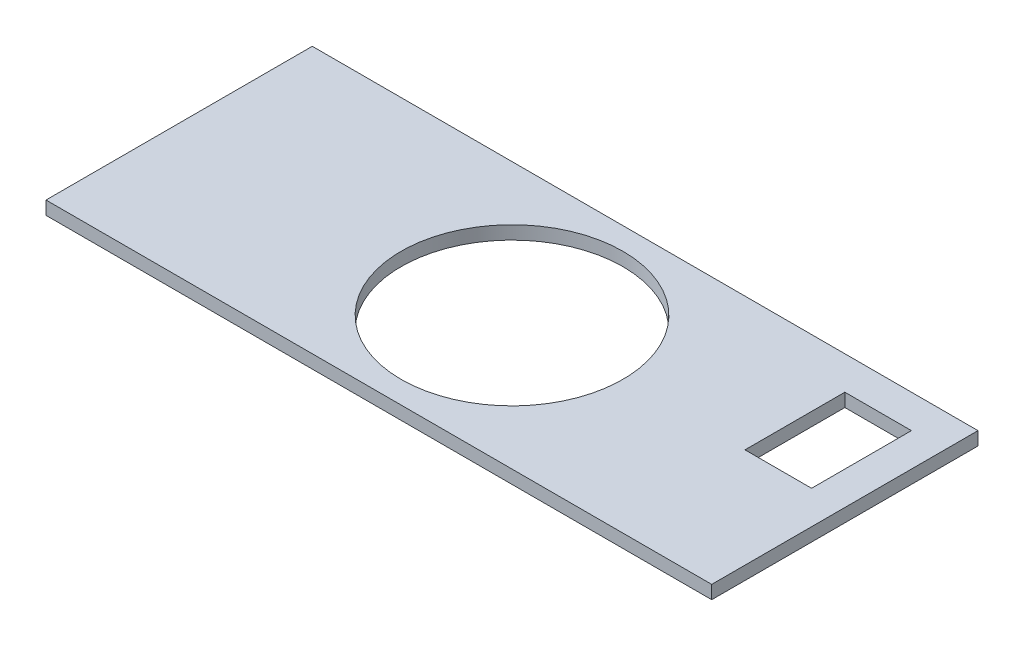
ISO-10303-21;
HEADER;
FILE_DESCRIPTION(('STEP AP214'),'2;1');
FILE_NAME('part.step','',(''),(''),'','','');
FILE_SCHEMA(('AUTOMOTIVE_DESIGN { 1 0 10303 214 1 1 1 1 }'));
ENDSEC;
DATA;
#1=APPLICATION_CONTEXT('core data for automotive mechanical design processes');
#2=APPLICATION_PROTOCOL_DEFINITION('international standard','automotive_design',2000,#1);
#3=PRODUCT_CONTEXT('',#1,'mechanical');
#4=PRODUCT('Part','Part','',(#3));
#5=PRODUCT_RELATED_PRODUCT_CATEGORY('part','',(#4));
#6=PRODUCT_DEFINITION_FORMATION('','',#4);
#7=PRODUCT_DEFINITION_CONTEXT('part definition',#1,'design');
#8=PRODUCT_DEFINITION('design','',#6,#7);
#9=PRODUCT_DEFINITION_SHAPE('','',#8);
#10=(LENGTH_UNIT() NAMED_UNIT(*) SI_UNIT(.MILLI.,.METRE.));
#11=(NAMED_UNIT(*) PLANE_ANGLE_UNIT() SI_UNIT($,.RADIAN.));
#12=(NAMED_UNIT(*) SI_UNIT($,.STERADIAN.) SOLID_ANGLE_UNIT());
#13=UNCERTAINTY_MEASURE_WITH_UNIT(LENGTH_MEASURE(1.E-05),#10,'distance_accuracy_value','');
#14=(GEOMETRIC_REPRESENTATION_CONTEXT(3) GLOBAL_UNCERTAINTY_ASSIGNED_CONTEXT((#13)) GLOBAL_UNIT_ASSIGNED_CONTEXT((#10,
#11,#12)) REPRESENTATION_CONTEXT('',''));
#15=CARTESIAN_POINT('',(0.,0.,0.));
#16=DIRECTION('',(0.,0.,1.));
#17=DIRECTION('',(1.,0.,0.));
#18=AXIS2_PLACEMENT_3D('',#15,#16,#17);
#19=CARTESIAN_POINT('',(0.,6.,-60.));
#20=DIRECTION('',(0.,0.,1.));
#21=DIRECTION('',(1.,0.,0.));
#22=AXIS2_PLACEMENT_3D('',#19,#20,#21);
#23=PLANE('',#22);
#24=DIRECTION('',(-1.,0.,0.));
#25=VECTOR('',#24,1.);
#26=CARTESIAN_POINT('',(0.,0.,-60.));
#27=LINE('',#26,#25);
#28=CARTESIAN_POINT('',(285.,0.,-60.));
#29=VERTEX_POINT('',#28);
#30=CARTESIAN_POINT('',(255.,0.,-60.));
#31=VERTEX_POINT('',#30);
#32=EDGE_CURVE('E151',#29,#31,#27,.T.);
#33=ORIENTED_EDGE('',*,*,#32,.T.);
#34=DIRECTION('',(0.,-1.,0.));
#35=VECTOR('',#34,1.);
#36=CARTESIAN_POINT('',(255.,6.,-60.));
#37=LINE('',#36,#35);
#38=CARTESIAN_POINT('',(255.,6.,-60.));
#39=VERTEX_POINT('',#38);
#40=EDGE_CURVE('E11',#39,#31,#37,.T.);
#41=ORIENTED_EDGE('',*,*,#40,.F.);
#42=DIRECTION('',(-1.,0.,0.));
#43=VECTOR('',#42,1.);
#44=CARTESIAN_POINT('',(0.,6.,-60.));
#45=LINE('',#44,#43);
#46=CARTESIAN_POINT('',(285.,6.,-60.));
#47=VERTEX_POINT('',#46);
#48=EDGE_CURVE('E120',#47,#39,#45,.T.);
#49=ORIENTED_EDGE('',*,*,#48,.F.);
#50=DIRECTION('',(0.,-1.,0.));
#51=VECTOR('',#50,1.);
#52=CARTESIAN_POINT('',(285.,6.,-60.));
#53=LINE('',#52,#51);
#54=EDGE_CURVE('E59',#47,#29,#53,.T.);
#55=ORIENTED_EDGE('',*,*,#54,.T.);
#56=EDGE_LOOP('',(#33,#41,#49,#55));
#57=FACE_BOUND('',#56,.T.);
#58=ADVANCED_FACE('F40',(#57),#23,.F.);
#59=CARTESIAN_POINT('',(255.,6.,0.));
#60=DIRECTION('',(-1.,0.,0.));
#61=DIRECTION('',(0.,0.,1.));
#62=AXIS2_PLACEMENT_3D('',#59,#60,#61);
#63=PLANE('',#62);
#64=DIRECTION('',(0.,0.,-1.));
#65=VECTOR('',#64,1.);
#66=CARTESIAN_POINT('',(255.,0.,0.));
#67=LINE('',#66,#65);
#68=CARTESIAN_POINT('',(255.,0.,-105.));
#69=VERTEX_POINT('',#68);
#70=EDGE_CURVE('E126',#31,#69,#67,.T.);
#71=ORIENTED_EDGE('',*,*,#70,.T.);
#72=DIRECTION('',(0.,-1.,0.));
#73=VECTOR('',#72,1.);
#74=CARTESIAN_POINT('',(255.,6.,-105.));
#75=LINE('',#74,#73);
#76=CARTESIAN_POINT('',(255.,6.,-105.));
#77=VERTEX_POINT('',#76);
#78=EDGE_CURVE('E50',#77,#69,#75,.T.);
#79=ORIENTED_EDGE('',*,*,#78,.F.);
#80=DIRECTION('',(0.,0.,-1.));
#81=VECTOR('',#80,1.);
#82=CARTESIAN_POINT('',(255.,6.,0.));
#83=LINE('',#82,#81);
#84=EDGE_CURVE('E114',#39,#77,#83,.T.);
#85=ORIENTED_EDGE('',*,*,#84,.F.);
#86=ORIENTED_EDGE('',*,*,#40,.T.);
#87=EDGE_LOOP('',(#71,#79,#85,#86));
#88=FACE_BOUND('',#87,.T.);
#89=ADVANCED_FACE('F125',(#88),#63,.F.);
#90=CARTESIAN_POINT('',(0.,6.,-105.));
#91=DIRECTION('',(0.,0.,1.));
#92=DIRECTION('',(1.,0.,0.));
#93=AXIS2_PLACEMENT_3D('',#90,#91,#92);
#94=PLANE('',#93);
#95=DIRECTION('',(-1.,0.,0.));
#96=VECTOR('',#95,1.);
#97=CARTESIAN_POINT('',(0.,0.,-105.));
#98=LINE('',#97,#96);
#99=CARTESIAN_POINT('',(285.,0.,-105.));
#100=VERTEX_POINT('',#99);
#101=EDGE_CURVE('E154',#100,#69,#98,.T.);
#102=ORIENTED_EDGE('',*,*,#101,.F.);
#103=DIRECTION('',(0.,-1.,0.));
#104=VECTOR('',#103,1.);
#105=CARTESIAN_POINT('',(285.,6.,-105.));
#106=LINE('',#105,#104);
#107=CARTESIAN_POINT('',(285.,6.,-105.));
#108=VERTEX_POINT('',#107);
#109=EDGE_CURVE('E85',#108,#100,#106,.T.);
#110=ORIENTED_EDGE('',*,*,#109,.F.);
#111=DIRECTION('',(-1.,0.,0.));
#112=VECTOR('',#111,1.);
#113=CARTESIAN_POINT('',(0.,6.,-105.));
#114=LINE('',#113,#112);
#115=EDGE_CURVE('E119',#108,#77,#114,.T.);
#116=ORIENTED_EDGE('',*,*,#115,.T.);
#117=ORIENTED_EDGE('',*,*,#78,.T.);
#118=EDGE_LOOP('',(#102,#110,#116,#117));
#119=FACE_BOUND('',#118,.T.);
#120=ADVANCED_FACE('F130',(#119),#94,.T.);
#121=CARTESIAN_POINT('',(300.,6.,-1.38777878078145E-13));
#122=DIRECTION('',(-1.,0.,0.));
#123=DIRECTION('',(0.,0.,1.));
#124=AXIS2_PLACEMENT_3D('',#121,#122,#123);
#125=PLANE('',#124);
#126=DIRECTION('',(0.,0.,-1.));
#127=VECTOR('',#126,1.);
#128=CARTESIAN_POINT('',(300.,0.,-1.38777878078145E-13));
#129=LINE('',#128,#127);
#130=CARTESIAN_POINT('',(300.,0.,0.));
#131=VERTEX_POINT('',#130);
#132=CARTESIAN_POINT('',(300.,0.,-120.));
#133=VERTEX_POINT('',#132);
#134=EDGE_CURVE('E140',#131,#133,#129,.T.);
#135=ORIENTED_EDGE('',*,*,#134,.T.);
#136=DIRECTION('',(0.,-1.,0.));
#137=VECTOR('',#136,1.);
#138=CARTESIAN_POINT('',(300.,6.,-120.));
#139=LINE('',#138,#137);
#140=CARTESIAN_POINT('',(300.,6.,-120.));
#141=VERTEX_POINT('',#140);
#142=EDGE_CURVE('E44',#141,#133,#139,.T.);
#143=ORIENTED_EDGE('',*,*,#142,.F.);
#144=DIRECTION('',(0.,0.,-1.));
#145=VECTOR('',#144,1.);
#146=CARTESIAN_POINT('',(300.,6.,-1.38777878078145E-13));
#147=LINE('',#146,#145);
#148=CARTESIAN_POINT('',(300.,6.,0.));
#149=VERTEX_POINT('',#148);
#150=EDGE_CURVE('E98',#149,#141,#147,.T.);
#151=ORIENTED_EDGE('',*,*,#150,.F.);
#152=DIRECTION('',(0.,-1.,0.));
#153=VECTOR('',#152,1.);
#154=CARTESIAN_POINT('',(300.,6.,0.));
#155=LINE('',#154,#153);
#156=EDGE_CURVE('E133',#149,#131,#155,.T.);
#157=ORIENTED_EDGE('',*,*,#156,.T.);
#158=EDGE_LOOP('',(#135,#143,#151,#157));
#159=FACE_BOUND('',#158,.T.);
#160=ADVANCED_FACE('F176',(#159),#125,.F.);
#161=CARTESIAN_POINT('',(0.,6.,-120.));
#162=DIRECTION('',(0.,0.,-1.));
#163=DIRECTION('',(-1.,0.,0.));
#164=AXIS2_PLACEMENT_3D('',#161,#162,#163);
#165=PLANE('',#164);
#166=DIRECTION('',(1.,0.,0.));
#167=VECTOR('',#166,1.);
#168=CARTESIAN_POINT('',(0.,0.,-120.));
#169=LINE('',#168,#167);
#170=CARTESIAN_POINT('',(0.,0.,-120.));
#171=VERTEX_POINT('',#170);
#172=EDGE_CURVE('E143',#171,#133,#169,.T.);
#173=ORIENTED_EDGE('',*,*,#172,.F.);
#174=DIRECTION('',(0.,-1.,0.));
#175=VECTOR('',#174,1.);
#176=CARTESIAN_POINT('',(0.,6.,-120.));
#177=LINE('',#176,#175);
#178=CARTESIAN_POINT('',(0.,6.,-120.));
#179=VERTEX_POINT('',#178);
#180=EDGE_CURVE('E165',#179,#171,#177,.T.);
#181=ORIENTED_EDGE('',*,*,#180,.F.);
#182=DIRECTION('',(1.,0.,0.));
#183=VECTOR('',#182,1.);
#184=CARTESIAN_POINT('',(0.,6.,-120.));
#185=LINE('',#184,#183);
#186=EDGE_CURVE('E173',#179,#141,#185,.T.);
#187=ORIENTED_EDGE('',*,*,#186,.T.);
#188=ORIENTED_EDGE('',*,*,#142,.T.);
#189=EDGE_LOOP('',(#173,#181,#187,#188));
#190=FACE_BOUND('',#189,.T.);
#191=ADVANCED_FACE('F172',(#190),#165,.T.);
#192=CARTESIAN_POINT('',(0.,6.,0.));
#193=DIRECTION('',(-1.,0.,0.));
#194=DIRECTION('',(0.,0.,1.));
#195=AXIS2_PLACEMENT_3D('',#192,#193,#194);
#196=PLANE('',#195);
#197=DIRECTION('',(0.,0.,-1.));
#198=VECTOR('',#197,1.);
#199=CARTESIAN_POINT('',(0.,0.,0.));
#200=LINE('',#199,#198);
#201=CARTESIAN_POINT('',(0.,0.,0.));
#202=VERTEX_POINT('',#201);
#203=EDGE_CURVE('E146',#202,#171,#200,.T.);
#204=ORIENTED_EDGE('',*,*,#203,.F.);
#205=DIRECTION('',(0.,-1.,0.));
#206=VECTOR('',#205,1.);
#207=CARTESIAN_POINT('',(0.,6.,0.));
#208=LINE('',#207,#206);
#209=CARTESIAN_POINT('',(0.,6.,0.));
#210=VERTEX_POINT('',#209);
#211=EDGE_CURVE('E164',#210,#202,#208,.T.);
#212=ORIENTED_EDGE('',*,*,#211,.F.);
#213=DIRECTION('',(0.,0.,-1.));
#214=VECTOR('',#213,1.);
#215=CARTESIAN_POINT('',(0.,6.,0.));
#216=LINE('',#215,#214);
#217=EDGE_CURVE('E185',#210,#179,#216,.T.);
#218=ORIENTED_EDGE('',*,*,#217,.T.);
#219=ORIENTED_EDGE('',*,*,#180,.T.);
#220=EDGE_LOOP('',(#204,#212,#218,#219));
#221=FACE_BOUND('',#220,.T.);
#222=ADVANCED_FACE('F182',(#221),#196,.T.);
#223=CARTESIAN_POINT('',(0.,6.,0.));
#224=DIRECTION('',(0.,0.,-1.));
#225=DIRECTION('',(-1.,0.,0.));
#226=AXIS2_PLACEMENT_3D('',#223,#224,#225);
#227=PLANE('',#226);
#228=DIRECTION('',(1.,0.,0.));
#229=VECTOR('',#228,1.);
#230=CARTESIAN_POINT('',(0.,0.,0.));
#231=LINE('',#230,#229);
#232=EDGE_CURVE('E149',#202,#131,#231,.T.);
#233=ORIENTED_EDGE('',*,*,#232,.T.);
#234=ORIENTED_EDGE('',*,*,#156,.F.);
#235=DIRECTION('',(1.,0.,0.));
#236=VECTOR('',#235,1.);
#237=CARTESIAN_POINT('',(0.,6.,0.));
#238=LINE('',#237,#236);
#239=EDGE_CURVE('E187',#210,#149,#238,.T.);
#240=ORIENTED_EDGE('',*,*,#239,.F.);
#241=ORIENTED_EDGE('',*,*,#211,.T.);
#242=EDGE_LOOP('',(#233,#234,#240,#241));
#243=FACE_BOUND('',#242,.T.);
#244=ADVANCED_FACE('F188',(#243),#227,.F.);
#245=CARTESIAN_POINT('',(150.,6.,-60.));
#246=DIRECTION('',(0.,-1.,0.));
#247=DIRECTION('',(0.,0.,-1.));
#248=AXIS2_PLACEMENT_3D('',#245,#246,#247);
#249=CYLINDRICAL_SURFACE('',#248,50.);
#250=CARTESIAN_POINT('',(150.,6.,-60.));
#251=DIRECTION('',(0.,1.,0.));
#252=DIRECTION('',(0.,0.,1.));
#253=AXIS2_PLACEMENT_3D('',#250,#251,#252);
#254=CIRCLE('',#253,50.);
#255=CARTESIAN_POINT('',(150.,6.,-9.99999999999998));
#256=VERTEX_POINT('',#255);
#257=EDGE_CURVE('E159',#256,#256,#254,.T.);
#258=ORIENTED_EDGE('',*,*,#257,.T.);
#259=EDGE_LOOP('',(#258));
#260=FACE_BOUND('',#259,.T.);
#261=CARTESIAN_POINT('',(150.,0.,-60.));
#262=DIRECTION('',(0.,1.,0.));
#263=DIRECTION('',(0.,0.,1.));
#264=AXIS2_PLACEMENT_3D('',#261,#262,#263);
#265=CIRCLE('',#264,50.);
#266=CARTESIAN_POINT('',(150.,0.,-9.99999999999998));
#267=VERTEX_POINT('',#266);
#268=EDGE_CURVE('E137',#267,#267,#265,.T.);
#269=ORIENTED_EDGE('',*,*,#268,.F.);
#270=EDGE_LOOP('',(#269));
#271=FACE_BOUND('',#270,.T.);
#272=ADVANCED_FACE('F42',(#260,#271),#249,.F.);
#273=CARTESIAN_POINT('',(285.,6.,0.));
#274=DIRECTION('',(-1.,0.,0.));
#275=DIRECTION('',(0.,0.,1.));
#276=AXIS2_PLACEMENT_3D('',#273,#274,#275);
#277=PLANE('',#276);
#278=DIRECTION('',(0.,0.,-1.));
#279=VECTOR('',#278,1.);
#280=CARTESIAN_POINT('',(285.,0.,0.));
#281=LINE('',#280,#279);
#282=EDGE_CURVE('E156',#29,#100,#281,.T.);
#283=ORIENTED_EDGE('',*,*,#282,.F.);
#284=ORIENTED_EDGE('',*,*,#54,.F.);
#285=DIRECTION('',(0.,0.,-1.));
#286=VECTOR('',#285,1.);
#287=CARTESIAN_POINT('',(285.,6.,0.));
#288=LINE('',#287,#286);
#289=EDGE_CURVE('E131',#47,#108,#288,.T.);
#290=ORIENTED_EDGE('',*,*,#289,.T.);
#291=ORIENTED_EDGE('',*,*,#109,.T.);
#292=EDGE_LOOP('',(#283,#284,#290,#291));
#293=FACE_BOUND('',#292,.T.);
#294=ADVANCED_FACE('F200',(#293),#277,.T.);
#295=CARTESIAN_POINT('',(0.,6.,0.));
#296=DIRECTION('',(0.,1.,0.));
#297=DIRECTION('',(0.,0.,1.));
#298=AXIS2_PLACEMENT_3D('',#295,#296,#297);
#299=PLANE('',#298);
#300=ORIENTED_EDGE('',*,*,#257,.F.);
#301=EDGE_LOOP('',(#300));
#302=FACE_BOUND('',#301,.T.);
#303=ORIENTED_EDGE('',*,*,#150,.T.);
#304=ORIENTED_EDGE('',*,*,#186,.F.);
#305=ORIENTED_EDGE('',*,*,#217,.F.);
#306=ORIENTED_EDGE('',*,*,#239,.T.);
#307=EDGE_LOOP('',(#303,#304,#305,#306));
#308=FACE_BOUND('',#307,.T.);
#309=ORIENTED_EDGE('',*,*,#48,.T.);
#310=ORIENTED_EDGE('',*,*,#84,.T.);
#311=ORIENTED_EDGE('',*,*,#115,.F.);
#312=ORIENTED_EDGE('',*,*,#289,.F.);
#313=EDGE_LOOP('',(#309,#310,#311,#312));
#314=FACE_BOUND('',#313,.T.);
#315=ADVANCED_FACE('F116',(#302,#308,#314),#299,.T.);
#316=CARTESIAN_POINT('',(0.,0.,0.));
#317=DIRECTION('',(0.,1.,0.));
#318=DIRECTION('',(0.,0.,1.));
#319=AXIS2_PLACEMENT_3D('',#316,#317,#318);
#320=PLANE('',#319);
#321=ORIENTED_EDGE('',*,*,#268,.T.);
#322=EDGE_LOOP('',(#321));
#323=FACE_BOUND('',#322,.T.);
#324=ORIENTED_EDGE('',*,*,#134,.F.);
#325=ORIENTED_EDGE('',*,*,#232,.F.);
#326=ORIENTED_EDGE('',*,*,#203,.T.);
#327=ORIENTED_EDGE('',*,*,#172,.T.);
#328=EDGE_LOOP('',(#324,#325,#326,#327));
#329=FACE_BOUND('',#328,.T.);
#330=ORIENTED_EDGE('',*,*,#32,.F.);
#331=ORIENTED_EDGE('',*,*,#282,.T.);
#332=ORIENTED_EDGE('',*,*,#101,.T.);
#333=ORIENTED_EDGE('',*,*,#70,.F.);
#334=EDGE_LOOP('',(#330,#331,#332,#333));
#335=FACE_BOUND('',#334,.T.);
#336=ADVANCED_FACE('F180',(#323,#329,#335),#320,.F.);
#337=CLOSED_SHELL('',(#58,#89,#120,#160,#191,#222,#244,#272,#294,#315,#336));
#338=MANIFOLD_SOLID_BREP('B2',#337);
#339=ADVANCED_BREP_SHAPE_REPRESENTATION('',(#18,#338),#14);
#340=SHAPE_DEFINITION_REPRESENTATION(#9,#339);
ENDSEC;
END-ISO-10303-21;
